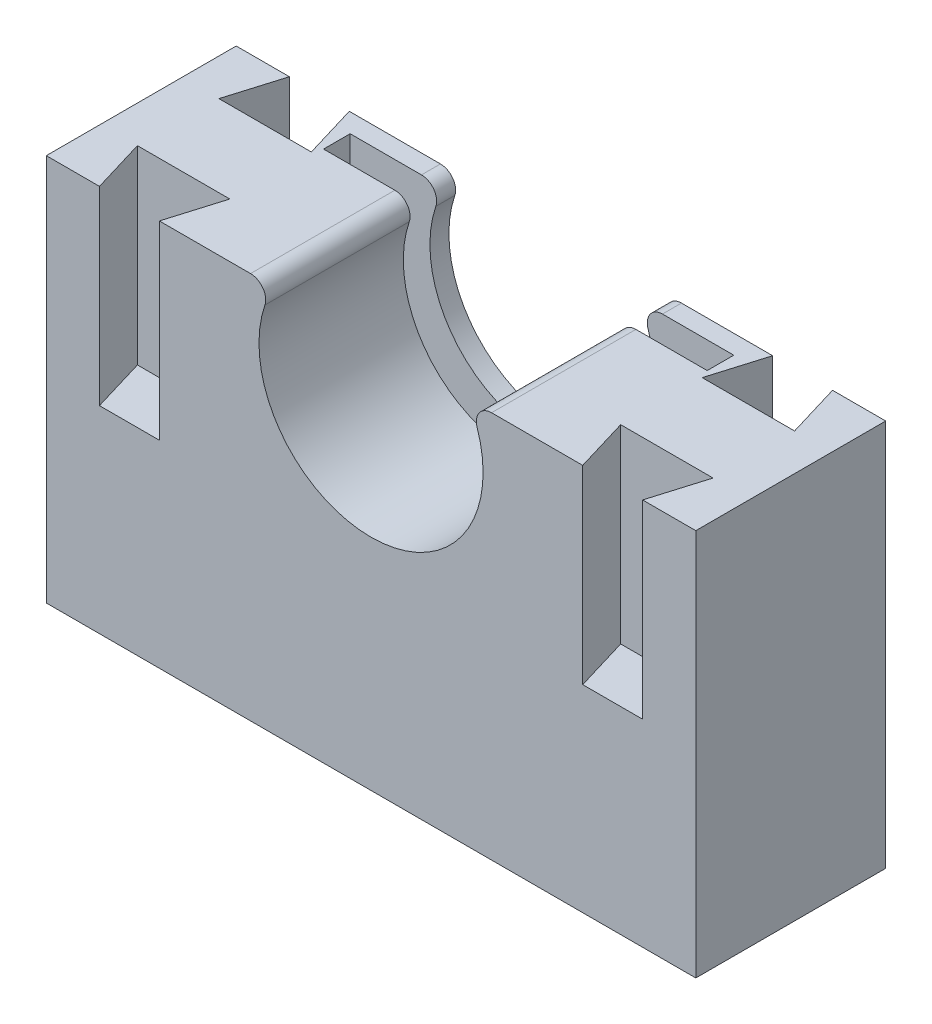
ISO-10303-21;
HEADER;
FILE_DESCRIPTION(('STEP AP214'),'2;1');
FILE_NAME('part.step','',(''),(''),'','','');
FILE_SCHEMA(('AUTOMOTIVE_DESIGN { 1 0 10303 214 1 1 1 1 }'));
ENDSEC;
DATA;
#1=APPLICATION_CONTEXT('core data for automotive mechanical design processes');
#2=APPLICATION_PROTOCOL_DEFINITION('international standard','automotive_design',2000,#1);
#3=PRODUCT_CONTEXT('',#1,'mechanical');
#4=PRODUCT('Part','Part','',(#3));
#5=PRODUCT_RELATED_PRODUCT_CATEGORY('part','',(#4));
#6=PRODUCT_DEFINITION_FORMATION('','',#4);
#7=PRODUCT_DEFINITION_CONTEXT('part definition',#1,'design');
#8=PRODUCT_DEFINITION('design','',#6,#7);
#9=PRODUCT_DEFINITION_SHAPE('','',#8);
#10=(LENGTH_UNIT() NAMED_UNIT(*) SI_UNIT(.MILLI.,.METRE.));
#11=(NAMED_UNIT(*) PLANE_ANGLE_UNIT() SI_UNIT($,.RADIAN.));
#12=(NAMED_UNIT(*) SI_UNIT($,.STERADIAN.) SOLID_ANGLE_UNIT());
#13=UNCERTAINTY_MEASURE_WITH_UNIT(LENGTH_MEASURE(1.E-05),#10,'distance_accuracy_value','');
#14=(GEOMETRIC_REPRESENTATION_CONTEXT(3) GLOBAL_UNCERTAINTY_ASSIGNED_CONTEXT((#13)) GLOBAL_UNIT_ASSIGNED_CONTEXT((#10,
#11,#12)) REPRESENTATION_CONTEXT('',''));
#15=CARTESIAN_POINT('',(0.,0.,0.));
#16=DIRECTION('',(0.,0.,1.));
#17=DIRECTION('',(1.,0.,0.));
#18=AXIS2_PLACEMENT_3D('',#15,#16,#17);
#19=CARTESIAN_POINT('',(27.0146670463276,26.0149253731343,25.));
#20=DIRECTION('',(0.,0.,-1.));
#21=DIRECTION('',(-1.,0.,0.));
#22=AXIS2_PLACEMENT_3D('',#19,#20,#21);
#23=CYLINDRICAL_SURFACE('',#22,2.);
#24=CARTESIAN_POINT('',(27.0146670463276,26.0149253731343,2.5));
#25=DIRECTION('',(0.,0.,1.));
#26=DIRECTION('',(1.,0.,0.));
#27=AXIS2_PLACEMENT_3D('',#24,#25,#26);
#28=CIRCLE('',#27,2.);
#29=CARTESIAN_POINT('',(27.0146670463276,28.0149253731343,2.5));
#30=VERTEX_POINT('',#29);
#31=CARTESIAN_POINT('',(25.1204378482512,25.3731343283582,2.5));
#32=VERTEX_POINT('',#31);
#33=EDGE_CURVE('E296',#30,#32,#28,.T.);
#34=ORIENTED_EDGE('',*,*,#33,.F.);
#35=DIRECTION('',(0.,0.,-1.));
#36=VECTOR('',#35,1.);
#37=CARTESIAN_POINT('',(27.0146670463276,28.0149253731343,25.));
#38=LINE('',#37,#36);
#39=CARTESIAN_POINT('',(27.0146670463276,28.0149253731343,0.));
#40=VERTEX_POINT('',#39);
#41=EDGE_CURVE('E549',#30,#40,#38,.T.);
#42=ORIENTED_EDGE('',*,*,#41,.T.);
#43=CARTESIAN_POINT('',(27.0146670463276,26.0149253731343,0.));
#44=DIRECTION('',(0.,0.,1.));
#45=DIRECTION('',(1.,0.,0.));
#46=AXIS2_PLACEMENT_3D('',#43,#44,#45);
#47=CIRCLE('',#46,2.);
#48=CARTESIAN_POINT('',(25.1204378482512,25.3731343283582,0.));
#49=VERTEX_POINT('',#48);
#50=EDGE_CURVE('E501',#40,#49,#47,.T.);
#51=ORIENTED_EDGE('',*,*,#50,.T.);
#52=DIRECTION('',(0.,0.,-1.));
#53=VECTOR('',#52,1.);
#54=CARTESIAN_POINT('',(25.1204378482512,25.3731343283582,25.));
#55=LINE('',#54,#53);
#56=EDGE_CURVE('E544',#32,#49,#55,.T.);
#57=ORIENTED_EDGE('',*,*,#56,.F.);
#58=EDGE_LOOP('',(#34,#42,#51,#57));
#59=FACE_BOUND('',#58,.T.);
#60=ADVANCED_FACE('F44',(#59),#23,.T.);
#61=CARTESIAN_POINT('',(11.1504975124378,20.6399253731341,25.));
#62=DIRECTION('',(0.,0.,-1.));
#63=DIRECTION('',(-1.,0.,0.));
#64=AXIS2_PLACEMENT_3D('',#61,#62,#63);
#65=CYLINDRICAL_SURFACE('',#64,14.75);
#66=CARTESIAN_POINT('',(11.1504975124378,20.6399253731341,2.5));
#67=DIRECTION('',(0.,0.,1.));
#68=DIRECTION('',(1.,0.,0.));
#69=AXIS2_PLACEMENT_3D('',#66,#67,#68);
#70=CIRCLE('',#69,14.75);
#71=CARTESIAN_POINT('',(-2.81944282337562,25.3731343283582,2.5));
#72=VERTEX_POINT('',#71);
#73=EDGE_CURVE('E60',#32,#72,#70,.F.);
#74=ORIENTED_EDGE('',*,*,#73,.F.);
#75=ORIENTED_EDGE('',*,*,#56,.T.);
#76=CARTESIAN_POINT('',(11.1504975124378,20.6399253731341,0.));
#77=DIRECTION('',(0.,0.,-1.));
#78=DIRECTION('',(1.,0.,0.));
#79=AXIS2_PLACEMENT_3D('',#76,#77,#78);
#80=CIRCLE('',#79,14.75);
#81=CARTESIAN_POINT('',(-2.81944282337562,25.3731343283582,0.));
#82=VERTEX_POINT('',#81);
#83=EDGE_CURVE('E505',#49,#82,#80,.T.);
#84=ORIENTED_EDGE('',*,*,#83,.T.);
#85=DIRECTION('',(0.,0.,-1.));
#86=VECTOR('',#85,1.);
#87=CARTESIAN_POINT('',(-2.81944282337562,25.3731343283582,25.));
#88=LINE('',#87,#86);
#89=EDGE_CURVE('E539',#72,#82,#88,.T.);
#90=ORIENTED_EDGE('',*,*,#89,.F.);
#91=EDGE_LOOP('',(#74,#75,#84,#90));
#92=FACE_BOUND('',#91,.T.);
#93=ADVANCED_FACE('F672',(#92),#65,.F.);
#94=CARTESIAN_POINT('',(-4.71367202145201,26.0149253731343,25.));
#95=DIRECTION('',(0.,0.,-1.));
#96=DIRECTION('',(-1.,0.,0.));
#97=AXIS2_PLACEMENT_3D('',#94,#95,#96);
#98=CYLINDRICAL_SURFACE('',#97,2.);
#99=CARTESIAN_POINT('',(-4.71367202145201,26.0149253731343,2.5));
#100=DIRECTION('',(0.,0.,1.));
#101=DIRECTION('',(1.,0.,0.));
#102=AXIS2_PLACEMENT_3D('',#99,#100,#101);
#103=CIRCLE('',#102,2.);
#104=CARTESIAN_POINT('',(-4.71367202145201,28.0149253731343,2.5));
#105=VERTEX_POINT('',#104);
#106=EDGE_CURVE('E53',#72,#105,#103,.T.);
#107=ORIENTED_EDGE('',*,*,#106,.F.);
#108=ORIENTED_EDGE('',*,*,#89,.T.);
#109=CARTESIAN_POINT('',(-4.71367202145201,26.0149253731343,0.));
#110=DIRECTION('',(0.,0.,1.));
#111=DIRECTION('',(-1.,0.,0.));
#112=AXIS2_PLACEMENT_3D('',#109,#110,#111);
#113=CIRCLE('',#112,2.);
#114=CARTESIAN_POINT('',(-4.71367202145201,28.0149253731343,0.));
#115=VERTEX_POINT('',#114);
#116=EDGE_CURVE('E509',#82,#115,#113,.T.);
#117=ORIENTED_EDGE('',*,*,#116,.T.);
#118=DIRECTION('',(0.,0.,-1.));
#119=VECTOR('',#118,1.);
#120=CARTESIAN_POINT('',(-4.71367202145201,28.0149253731343,25.));
#121=LINE('',#120,#119);
#122=EDGE_CURVE('E534',#105,#115,#121,.T.);
#123=ORIENTED_EDGE('',*,*,#122,.F.);
#124=EDGE_LOOP('',(#107,#108,#117,#123));
#125=FACE_BOUND('',#124,.T.);
#126=ADVANCED_FACE('F577',(#125),#98,.T.);
#127=CARTESIAN_POINT('',(53.9004975124378,28.0149253731343,25.));
#128=DIRECTION('',(0.,-1.,0.));
#129=DIRECTION('',(1.,0.,0.));
#130=AXIS2_PLACEMENT_3D('',#127,#128,#129);
#131=PLANE('',#130);
#132=DIRECTION('',(0.,0.,-1.));
#133=VECTOR('',#132,1.);
#134=CARTESIAN_POINT('',(36.4004975124378,28.0149253731343,6.));
#135=LINE('',#134,#133);
#136=CARTESIAN_POINT('',(36.4004975124378,28.0149253731343,6.));
#137=VERTEX_POINT('',#136);
#138=CARTESIAN_POINT('',(36.4004975124378,28.0149253731343,2.5));
#139=VERTEX_POINT('',#138);
#140=EDGE_CURVE('E272',#137,#139,#135,.T.);
#141=ORIENTED_EDGE('',*,*,#140,.F.);
#142=DIRECTION('',(1.,0.,0.));
#143=VECTOR('',#142,1.);
#144=CARTESIAN_POINT('',(36.4004975124378,28.0149253731343,6.));
#145=LINE('',#144,#143);
#146=CARTESIAN_POINT('',(27.0146670463276,28.0149253731343,6.));
#147=VERTEX_POINT('',#146);
#148=EDGE_CURVE('E254',#147,#137,#145,.T.);
#149=ORIENTED_EDGE('',*,*,#148,.F.);
#150=CARTESIAN_POINT('',(27.0146670463276,28.0149253731343,25.));
#151=VERTEX_POINT('',#150);
#152=EDGE_CURVE('E550',#151,#147,#38,.T.);
#153=ORIENTED_EDGE('',*,*,#152,.F.);
#154=DIRECTION('',(-1.,0.,0.));
#155=VECTOR('',#154,1.);
#156=CARTESIAN_POINT('',(53.9004975124378,28.0149253731343,25.));
#157=LINE('',#156,#155);
#158=CARTESIAN_POINT('',(39.0146670463276,28.0149253731343,25.));
#159=VERTEX_POINT('',#158);
#160=EDGE_CURVE('E467',#159,#151,#157,.T.);
#161=ORIENTED_EDGE('',*,*,#160,.F.);
#162=DIRECTION('',(-0.287193343911959,0.,-0.957872634128707));
#163=VECTOR('',#162,1.);
#164=CARTESIAN_POINT('',(39.0146670463276,28.0149253731343,25.));
#165=LINE('',#164,#163);
#166=CARTESIAN_POINT('',(36.8750766341835,28.0149253731343,17.8638488757411));
#167=VERTEX_POINT('',#166);
#168=EDGE_CURVE('E366',#159,#167,#165,.T.);
#169=ORIENTED_EDGE('',*,*,#168,.T.);
#170=DIRECTION('',(1.,0.,0.));
#171=VECTOR('',#170,1.);
#172=CARTESIAN_POINT('',(36.8750766341835,28.0149253731343,17.8638488757411));
#173=LINE('',#172,#171);
#174=CARTESIAN_POINT('',(49.0400879245819,28.0149253731343,17.8638488757411));
#175=VERTEX_POINT('',#174);
#176=EDGE_CURVE('E370',#167,#175,#173,.T.);
#177=ORIENTED_EDGE('',*,*,#176,.T.);
#178=DIRECTION('',(-0.287193343911958,0.,0.957872634128707));
#179=VECTOR('',#178,1.);
#180=CARTESIAN_POINT('',(49.0400879245819,28.0149253731343,17.8638488757411));
#181=LINE('',#180,#179);
#182=CARTESIAN_POINT('',(46.9004975124378,28.0149253731343,25.));
#183=VERTEX_POINT('',#182);
#184=EDGE_CURVE('E374',#175,#183,#181,.T.);
#185=ORIENTED_EDGE('',*,*,#184,.T.);
#186=CARTESIAN_POINT('',(53.9004975124378,28.0149253731343,25.));
#187=VERTEX_POINT('',#186);
#188=EDGE_CURVE('E469',#187,#183,#157,.T.);
#189=ORIENTED_EDGE('',*,*,#188,.F.);
#190=DIRECTION('',(0.,0.,-1.));
#191=VECTOR('',#190,1.);
#192=CARTESIAN_POINT('',(53.9004975124378,28.0149253731343,25.));
#193=LINE('',#192,#191);
#194=CARTESIAN_POINT('',(53.9004975124378,28.0149253731343,0.));
#195=VERTEX_POINT('',#194);
#196=EDGE_CURVE('E553',#187,#195,#193,.T.);
#197=ORIENTED_EDGE('',*,*,#196,.T.);
#198=DIRECTION('',(-1.,0.,0.));
#199=VECTOR('',#198,1.);
#200=CARTESIAN_POINT('',(53.9004975124378,28.0149253731343,0.));
#201=LINE('',#200,#199);
#202=CARTESIAN_POINT('',(46.9004975124378,28.0149253731343,0.));
#203=VERTEX_POINT('',#202);
#204=EDGE_CURVE('E497',#195,#203,#201,.T.);
#205=ORIENTED_EDGE('',*,*,#204,.T.);
#206=DIRECTION('',(0.287193343911966,0.,0.957872634128704));
#207=VECTOR('',#206,1.);
#208=CARTESIAN_POINT('',(46.9004975124378,28.0149253731343,0.));
#209=LINE('',#208,#207);
#210=CARTESIAN_POINT('',(49.040087924582,28.0149253731343,7.13615112425885));
#211=VERTEX_POINT('',#210);
#212=EDGE_CURVE('E378',#203,#211,#209,.T.);
#213=ORIENTED_EDGE('',*,*,#212,.T.);
#214=DIRECTION('',(-1.,0.,0.));
#215=VECTOR('',#214,1.);
#216=CARTESIAN_POINT('',(49.040087924582,28.0149253731343,7.13615112425885));
#217=LINE('',#216,#215);
#218=CARTESIAN_POINT('',(36.8750766341835,28.0149253731343,7.13615112425885));
#219=VERTEX_POINT('',#218);
#220=EDGE_CURVE('E382',#211,#219,#217,.T.);
#221=ORIENTED_EDGE('',*,*,#220,.T.);
#222=DIRECTION('',(0.287193343911964,0.,-0.957872634128705));
#223=VECTOR('',#222,1.);
#224=CARTESIAN_POINT('',(36.8750766341835,28.0149253731343,7.13615112425885));
#225=LINE('',#224,#223);
#226=CARTESIAN_POINT('',(39.0146670463276,28.0149253731343,0.));
#227=VERTEX_POINT('',#226);
#228=EDGE_CURVE('E386',#219,#227,#225,.T.);
#229=ORIENTED_EDGE('',*,*,#228,.T.);
#230=EDGE_CURVE('E496',#227,#40,#201,.T.);
#231=ORIENTED_EDGE('',*,*,#230,.T.);
#232=ORIENTED_EDGE('',*,*,#41,.F.);
#233=DIRECTION('',(1.,0.,0.));
#234=VECTOR('',#233,1.);
#235=CARTESIAN_POINT('',(36.4004975124378,28.0149253731343,2.5));
#236=LINE('',#235,#234);
#237=EDGE_CURVE('E282',#30,#139,#236,.T.);
#238=ORIENTED_EDGE('',*,*,#237,.T.);
#239=EDGE_LOOP('',(#141,#149,#153,#161,#169,#177,#185,#189,#197,#205,#213,#221,#229,#231,#232,#238));
#240=FACE_BOUND('',#239,.T.);
#241=ADVANCED_FACE('F280',(#240),#131,.F.);
#242=CARTESIAN_POINT('',(-4.71367202145201,28.0149253731343,25.));
#243=DIRECTION('',(0.,-1.,0.));
#244=DIRECTION('',(1.,0.,0.));
#245=AXIS2_PLACEMENT_3D('',#242,#243,#244);
#246=PLANE('',#245);
#247=CARTESIAN_POINT('',(-4.71367202145201,28.0149253731343,25.));
#248=VERTEX_POINT('',#247);
#249=CARTESIAN_POINT('',(-4.71367202145201,28.0149253731343,6.));
#250=VERTEX_POINT('',#249);
#251=EDGE_CURVE('E535',#248,#250,#121,.T.);
#252=ORIENTED_EDGE('',*,*,#251,.T.);
#253=CARTESIAN_POINT('',(-14.0995024875622,28.0149253731343,6.));
#254=VERTEX_POINT('',#253);
#255=EDGE_CURVE('E266',#254,#250,#145,.T.);
#256=ORIENTED_EDGE('',*,*,#255,.F.);
#257=DIRECTION('',(0.,0.,-1.));
#258=VECTOR('',#257,1.);
#259=CARTESIAN_POINT('',(-14.0995024875622,28.0149253731343,6.));
#260=LINE('',#259,#258);
#261=CARTESIAN_POINT('',(-14.0995024875622,28.0149253731343,2.5));
#262=VERTEX_POINT('',#261);
#263=EDGE_CURVE('E297',#254,#262,#260,.T.);
#264=ORIENTED_EDGE('',*,*,#263,.T.);
#265=EDGE_CURVE('E565',#262,#105,#236,.T.);
#266=ORIENTED_EDGE('',*,*,#265,.T.);
#267=ORIENTED_EDGE('',*,*,#122,.T.);
#268=DIRECTION('',(-1.,0.,0.));
#269=VECTOR('',#268,1.);
#270=CARTESIAN_POINT('',(-4.71367202145201,28.0149253731343,0.));
#271=LINE('',#270,#269);
#272=CARTESIAN_POINT('',(-16.713672021452,28.0149253731343,0.));
#273=VERTEX_POINT('',#272);
#274=EDGE_CURVE('E514',#115,#273,#271,.T.);
#275=ORIENTED_EDGE('',*,*,#274,.T.);
#276=DIRECTION('',(0.287115798996212,0.,0.95789588054588));
#277=VECTOR('',#276,1.);
#278=CARTESIAN_POINT('',(-14.5746593189302,28.0149253731343,7.13632431006681));
#279=LINE('',#278,#277);
#280=CARTESIAN_POINT('',(-14.5746593189302,28.0149253731343,7.13632431006681));
#281=VERTEX_POINT('',#280);
#282=EDGE_CURVE('E390',#273,#281,#279,.T.);
#283=ORIENTED_EDGE('',*,*,#282,.T.);
#284=DIRECTION('',(-1.,0.,0.));
#285=VECTOR('',#284,1.);
#286=CARTESIAN_POINT('',(-26.738515190084,28.0149253731343,7.13632431006681));
#287=LINE('',#286,#285);
#288=CARTESIAN_POINT('',(-26.738515190084,28.0149253731343,7.13632431006681));
#289=VERTEX_POINT('',#288);
#290=EDGE_CURVE('E394',#281,#289,#287,.T.);
#291=ORIENTED_EDGE('',*,*,#290,.T.);
#292=DIRECTION('',(0.287115798996211,0.,-0.95789588054588));
#293=VECTOR('',#292,1.);
#294=CARTESIAN_POINT('',(-24.5995024875622,28.0149253731343,0.));
#295=LINE('',#294,#293);
#296=CARTESIAN_POINT('',(-24.5995024875622,28.0149253731343,0.));
#297=VERTEX_POINT('',#296);
#298=EDGE_CURVE('E311',#289,#297,#295,.T.);
#299=ORIENTED_EDGE('',*,*,#298,.T.);
#300=CARTESIAN_POINT('',(-31.5995024875622,28.0149253731343,0.));
#301=VERTEX_POINT('',#300);
#302=EDGE_CURVE('E513',#297,#301,#271,.T.);
#303=ORIENTED_EDGE('',*,*,#302,.T.);
#304=DIRECTION('',(0.,0.,-1.));
#305=VECTOR('',#304,1.);
#306=CARTESIAN_POINT('',(-31.5995024875622,28.0149253731343,25.));
#307=LINE('',#306,#305);
#308=CARTESIAN_POINT('',(-31.5995024875622,28.0149253731343,25.));
#309=VERTEX_POINT('',#308);
#310=EDGE_CURVE('E530',#309,#301,#307,.T.);
#311=ORIENTED_EDGE('',*,*,#310,.F.);
#312=DIRECTION('',(-1.,0.,0.));
#313=VECTOR('',#312,1.);
#314=CARTESIAN_POINT('',(-4.71367202145201,28.0149253731343,25.));
#315=LINE('',#314,#313);
#316=CARTESIAN_POINT('',(-24.5995024875622,28.0149253731343,25.));
#317=VERTEX_POINT('',#316);
#318=EDGE_CURVE('E482',#317,#309,#315,.T.);
#319=ORIENTED_EDGE('',*,*,#318,.F.);
#320=DIRECTION('',(-0.28719334391196,0.,-0.957872634128706));
#321=VECTOR('',#320,1.);
#322=CARTESIAN_POINT('',(-24.5995024875622,28.0149253731343,25.));
#323=LINE('',#322,#321);
#324=CARTESIAN_POINT('',(-26.7390928997063,28.0149253731343,17.8638488757411));
#325=VERTEX_POINT('',#324);
#326=EDGE_CURVE('E68',#317,#325,#323,.T.);
#327=ORIENTED_EDGE('',*,*,#326,.T.);
#328=DIRECTION('',(1.,0.,0.));
#329=VECTOR('',#328,1.);
#330=CARTESIAN_POINT('',(-26.7390928997063,28.0149253731343,17.8638488757411));
#331=LINE('',#330,#329);
#332=CARTESIAN_POINT('',(-14.5740816093079,28.0149253731343,17.8638488757411));
#333=VERTEX_POINT('',#332);
#334=EDGE_CURVE('E358',#325,#333,#331,.T.);
#335=ORIENTED_EDGE('',*,*,#334,.T.);
#336=DIRECTION('',(-0.287193343911959,0.,0.957872634128707));
#337=VECTOR('',#336,1.);
#338=CARTESIAN_POINT('',(-14.5740816093079,28.0149253731343,17.8638488757411));
#339=LINE('',#338,#337);
#340=CARTESIAN_POINT('',(-16.713672021452,28.0149253731343,25.));
#341=VERTEX_POINT('',#340);
#342=EDGE_CURVE('E362',#333,#341,#339,.T.);
#343=ORIENTED_EDGE('',*,*,#342,.T.);
#344=EDGE_CURVE('E483',#248,#341,#315,.T.);
#345=ORIENTED_EDGE('',*,*,#344,.F.);
#346=EDGE_LOOP('',(#252,#256,#264,#266,#267,#275,#283,#291,#299,#303,#311,#319,#327,#335,#343,#345));
#347=FACE_BOUND('',#346,.T.);
#348=ADVANCED_FACE('F572',(#347),#246,.F.);
#349=CARTESIAN_POINT('',(-4.71367202145201,26.0149253731343,25.));
#350=DIRECTION('',(0.,0.,-1.));
#351=DIRECTION('',(-1.,0.,0.));
#352=AXIS2_PLACEMENT_3D('',#349,#350,#351);
#353=PLANE('',#352);
#354=DIRECTION('',(0.,1.,0.));
#355=VECTOR('',#354,1.);
#356=CARTESIAN_POINT('',(46.9004975124378,3.01492537313434,25.));
#357=LINE('',#356,#355);
#358=CARTESIAN_POINT('',(46.9004975124378,3.01492537313434,25.));
#359=VERTEX_POINT('',#358);
#360=EDGE_CURVE('E428',#359,#183,#357,.T.);
#361=ORIENTED_EDGE('',*,*,#360,.F.);
#362=DIRECTION('',(1.,0.,0.));
#363=VECTOR('',#362,1.);
#364=CARTESIAN_POINT('',(-4.71367202145201,3.01492537313433,25.));
#365=LINE('',#364,#363);
#366=CARTESIAN_POINT('',(39.0146670463276,3.01492537313434,25.));
#367=VERTEX_POINT('',#366);
#368=EDGE_CURVE('E404',#367,#359,#365,.T.);
#369=ORIENTED_EDGE('',*,*,#368,.F.);
#370=DIRECTION('',(0.,1.,0.));
#371=VECTOR('',#370,1.);
#372=CARTESIAN_POINT('',(39.0146670463276,3.01492537313434,25.));
#373=LINE('',#372,#371);
#374=EDGE_CURVE('E437',#367,#159,#373,.T.);
#375=ORIENTED_EDGE('',*,*,#374,.T.);
#376=ORIENTED_EDGE('',*,*,#160,.T.);
#377=CARTESIAN_POINT('',(27.0146670463276,26.0149253731343,25.));
#378=DIRECTION('',(0.,0.,1.));
#379=DIRECTION('',(1.,0.,0.));
#380=AXIS2_PLACEMENT_3D('',#377,#378,#379);
#381=CIRCLE('',#380,2.);
#382=CARTESIAN_POINT('',(25.1204378482512,25.3731343283582,25.));
#383=VERTEX_POINT('',#382);
#384=EDGE_CURVE('E473',#151,#383,#381,.T.);
#385=ORIENTED_EDGE('',*,*,#384,.T.);
#386=CARTESIAN_POINT('',(11.1504975124378,20.6399253731341,25.));
#387=DIRECTION('',(0.,0.,-1.));
#388=DIRECTION('',(1.,0.,0.));
#389=AXIS2_PLACEMENT_3D('',#386,#387,#388);
#390=CIRCLE('',#389,14.75);
#391=CARTESIAN_POINT('',(-2.81944282337562,25.3731343283582,25.));
#392=VERTEX_POINT('',#391);
#393=EDGE_CURVE('E476',#383,#392,#390,.T.);
#394=ORIENTED_EDGE('',*,*,#393,.T.);
#395=CARTESIAN_POINT('',(-4.71367202145201,26.0149253731343,25.));
#396=DIRECTION('',(0.,0.,1.));
#397=DIRECTION('',(-1.,0.,0.));
#398=AXIS2_PLACEMENT_3D('',#395,#396,#397);
#399=CIRCLE('',#398,2.);
#400=EDGE_CURVE('E479',#392,#248,#399,.T.);
#401=ORIENTED_EDGE('',*,*,#400,.T.);
#402=ORIENTED_EDGE('',*,*,#344,.T.);
#403=DIRECTION('',(0.,1.,0.));
#404=VECTOR('',#403,1.);
#405=CARTESIAN_POINT('',(-16.713672021452,3.01492537313433,25.));
#406=LINE('',#405,#404);
#407=CARTESIAN_POINT('',(-16.713672021452,3.01492537313433,25.));
#408=VERTEX_POINT('',#407);
#409=EDGE_CURVE('E441',#408,#341,#406,.T.);
#410=ORIENTED_EDGE('',*,*,#409,.F.);
#411=CARTESIAN_POINT('',(-24.5995024875622,3.01492537313433,25.));
#412=VERTEX_POINT('',#411);
#413=EDGE_CURVE('E454',#412,#408,#365,.T.);
#414=ORIENTED_EDGE('',*,*,#413,.F.);
#415=DIRECTION('',(0.,1.,0.));
#416=VECTOR('',#415,1.);
#417=CARTESIAN_POINT('',(-24.5995024875622,3.01492537313433,25.));
#418=LINE('',#417,#416);
#419=EDGE_CURVE('E355',#412,#317,#418,.T.);
#420=ORIENTED_EDGE('',*,*,#419,.T.);
#421=ORIENTED_EDGE('',*,*,#318,.T.);
#422=DIRECTION('',(0.,-1.,0.));
#423=VECTOR('',#422,1.);
#424=CARTESIAN_POINT('',(-31.5995024875622,28.0149253731343,25.));
#425=LINE('',#424,#423);
#426=CARTESIAN_POINT('',(-31.5995024875622,-22.9850746268657,25.));
#427=VERTEX_POINT('',#426);
#428=EDGE_CURVE('E487',#309,#427,#425,.T.);
#429=ORIENTED_EDGE('',*,*,#428,.T.);
#430=DIRECTION('',(1.,0.,0.));
#431=VECTOR('',#430,1.);
#432=CARTESIAN_POINT('',(53.9004975124378,-22.9850746268657,25.));
#433=LINE('',#432,#431);
#434=CARTESIAN_POINT('',(53.9004975124378,-22.9850746268657,25.));
#435=VERTEX_POINT('',#434);
#436=EDGE_CURVE('E490',#427,#435,#433,.T.);
#437=ORIENTED_EDGE('',*,*,#436,.T.);
#438=DIRECTION('',(0.,1.,0.));
#439=VECTOR('',#438,1.);
#440=CARTESIAN_POINT('',(53.9004975124378,28.0149253731343,25.));
#441=LINE('',#440,#439);
#442=EDGE_CURVE('E464',#435,#187,#441,.T.);
#443=ORIENTED_EDGE('',*,*,#442,.T.);
#444=ORIENTED_EDGE('',*,*,#188,.T.);
#445=EDGE_LOOP('',(#361,#369,#375,#376,#385,#394,#401,#402,#410,#414,#420,#421,#429,#437,#443,#444));
#446=FACE_BOUND('',#445,.T.);
#447=ADVANCED_FACE('F614',(#446),#353,.F.);
#448=CARTESIAN_POINT('',(53.9004975124378,28.0149253731343,25.));
#449=DIRECTION('',(-1.,0.,0.));
#450=DIRECTION('',(0.,0.,1.));
#451=AXIS2_PLACEMENT_3D('',#448,#449,#450);
#452=PLANE('',#451);
#453=ORIENTED_EDGE('',*,*,#196,.F.);
#454=ORIENTED_EDGE('',*,*,#442,.F.);
#455=DIRECTION('',(0.,0.,-1.));
#456=VECTOR('',#455,1.);
#457=CARTESIAN_POINT('',(53.9004975124378,-22.9850746268657,25.));
#458=LINE('',#457,#456);
#459=CARTESIAN_POINT('',(53.9004975124378,-22.9850746268657,0.));
#460=VERTEX_POINT('',#459);
#461=EDGE_CURVE('E493',#435,#460,#458,.T.);
#462=ORIENTED_EDGE('',*,*,#461,.T.);
#463=DIRECTION('',(0.,1.,0.));
#464=VECTOR('',#463,1.);
#465=CARTESIAN_POINT('',(53.9004975124378,28.0149253731343,0.));
#466=LINE('',#465,#464);
#467=EDGE_CURVE('E459',#460,#195,#466,.T.);
#468=ORIENTED_EDGE('',*,*,#467,.T.);
#469=EDGE_LOOP('',(#453,#454,#462,#468));
#470=FACE_BOUND('',#469,.T.);
#471=ADVANCED_FACE('F46',(#470),#452,.F.);
#472=ORIENTED_EDGE('',*,*,#152,.T.);
#473=CARTESIAN_POINT('',(27.0146670463276,26.0149253731343,6.));
#474=DIRECTION('',(0.,0.,1.));
#475=DIRECTION('',(1.,0.,0.));
#476=AXIS2_PLACEMENT_3D('',#473,#474,#475);
#477=CIRCLE('',#476,2.);
#478=CARTESIAN_POINT('',(25.1204378482512,25.3731343283582,6.));
#479=VERTEX_POINT('',#478);
#480=EDGE_CURVE('E260',#147,#479,#477,.T.);
#481=ORIENTED_EDGE('',*,*,#480,.T.);
#482=EDGE_CURVE('E545',#383,#479,#55,.T.);
#483=ORIENTED_EDGE('',*,*,#482,.F.);
#484=ORIENTED_EDGE('',*,*,#384,.F.);
#485=EDGE_LOOP('',(#472,#481,#483,#484));
#486=FACE_BOUND('',#485,.T.);
#487=ADVANCED_FACE('F622',(#486),#23,.T.);
#488=ORIENTED_EDGE('',*,*,#482,.T.);
#489=CARTESIAN_POINT('',(11.1504975124378,20.6399253731341,6.));
#490=DIRECTION('',(0.,0.,1.));
#491=DIRECTION('',(1.,0.,0.));
#492=AXIS2_PLACEMENT_3D('',#489,#490,#491);
#493=CIRCLE('',#492,14.75);
#494=CARTESIAN_POINT('',(-2.81944282337562,25.3731343283582,6.));
#495=VERTEX_POINT('',#494);
#496=EDGE_CURVE('E300',#479,#495,#493,.F.);
#497=ORIENTED_EDGE('',*,*,#496,.T.);
#498=EDGE_CURVE('E540',#392,#495,#88,.T.);
#499=ORIENTED_EDGE('',*,*,#498,.F.);
#500=ORIENTED_EDGE('',*,*,#393,.F.);
#501=EDGE_LOOP('',(#488,#497,#499,#500));
#502=FACE_BOUND('',#501,.T.);
#503=ADVANCED_FACE('F620',(#502),#65,.F.);
#504=ORIENTED_EDGE('',*,*,#498,.T.);
#505=CARTESIAN_POINT('',(-4.71367202145201,26.0149253731343,6.));
#506=DIRECTION('',(0.,0.,1.));
#507=DIRECTION('',(1.,0.,0.));
#508=AXIS2_PLACEMENT_3D('',#505,#506,#507);
#509=CIRCLE('',#508,2.);
#510=EDGE_CURVE('E12',#495,#250,#509,.T.);
#511=ORIENTED_EDGE('',*,*,#510,.T.);
#512=ORIENTED_EDGE('',*,*,#251,.F.);
#513=ORIENTED_EDGE('',*,*,#400,.F.);
#514=EDGE_LOOP('',(#504,#511,#512,#513));
#515=FACE_BOUND('',#514,.T.);
#516=ADVANCED_FACE('F606',(#515),#98,.T.);
#517=CARTESIAN_POINT('',(-31.5995024875622,28.0149253731343,25.));
#518=DIRECTION('',(1.,0.,0.));
#519=DIRECTION('',(0.,0.,-1.));
#520=AXIS2_PLACEMENT_3D('',#517,#518,#519);
#521=PLANE('',#520);
#522=DIRECTION('',(0.,-1.,0.));
#523=VECTOR('',#522,1.);
#524=CARTESIAN_POINT('',(-31.5995024875622,28.0149253731343,0.));
#525=LINE('',#524,#523);
#526=CARTESIAN_POINT('',(-31.5995024875622,-22.9850746268657,0.));
#527=VERTEX_POINT('',#526);
#528=EDGE_CURVE('E518',#301,#527,#525,.T.);
#529=ORIENTED_EDGE('',*,*,#528,.T.);
#530=DIRECTION('',(0.,0.,-1.));
#531=VECTOR('',#530,1.);
#532=CARTESIAN_POINT('',(-31.5995024875622,-22.9850746268657,25.));
#533=LINE('',#532,#531);
#534=EDGE_CURVE('E526',#427,#527,#533,.T.);
#535=ORIENTED_EDGE('',*,*,#534,.F.);
#536=ORIENTED_EDGE('',*,*,#428,.F.);
#537=ORIENTED_EDGE('',*,*,#310,.T.);
#538=EDGE_LOOP('',(#529,#535,#536,#537));
#539=FACE_BOUND('',#538,.T.);
#540=ADVANCED_FACE('F690',(#539),#521,.F.);
#541=CARTESIAN_POINT('',(53.9004975124378,-22.9850746268657,25.));
#542=DIRECTION('',(0.,1.,0.));
#543=DIRECTION('',(0.,0.,1.));
#544=AXIS2_PLACEMENT_3D('',#541,#542,#543);
#545=PLANE('',#544);
#546=DIRECTION('',(1.,0.,0.));
#547=VECTOR('',#546,1.);
#548=CARTESIAN_POINT('',(53.9004975124378,-22.9850746268657,0.));
#549=LINE('',#548,#547);
#550=EDGE_CURVE('E468',#527,#460,#549,.T.);
#551=ORIENTED_EDGE('',*,*,#550,.T.);
#552=ORIENTED_EDGE('',*,*,#461,.F.);
#553=ORIENTED_EDGE('',*,*,#436,.F.);
#554=ORIENTED_EDGE('',*,*,#534,.T.);
#555=EDGE_LOOP('',(#551,#552,#553,#554));
#556=FACE_BOUND('',#555,.T.);
#557=ADVANCED_FACE('F693',(#556),#545,.F.);
#558=CARTESIAN_POINT('',(-4.71367202145201,26.0149253731343,0.));
#559=DIRECTION('',(0.,0.,-1.));
#560=DIRECTION('',(-1.,0.,0.));
#561=AXIS2_PLACEMENT_3D('',#558,#559,#560);
#562=PLANE('',#561);
#563=ORIENTED_EDGE('',*,*,#204,.F.);
#564=ORIENTED_EDGE('',*,*,#467,.F.);
#565=ORIENTED_EDGE('',*,*,#550,.F.);
#566=ORIENTED_EDGE('',*,*,#528,.F.);
#567=ORIENTED_EDGE('',*,*,#302,.F.);
#568=DIRECTION('',(0.,1.,0.));
#569=VECTOR('',#568,1.);
#570=CARTESIAN_POINT('',(-24.5995024875622,3.01492537313433,0.));
#571=LINE('',#570,#569);
#572=CARTESIAN_POINT('',(-24.5995024875622,3.01492537313433,0.));
#573=VERTEX_POINT('',#572);
#574=EDGE_CURVE('E401',#573,#297,#571,.T.);
#575=ORIENTED_EDGE('',*,*,#574,.F.);
#576=DIRECTION('',(1.,0.,0.));
#577=VECTOR('',#576,1.);
#578=CARTESIAN_POINT('',(-4.71367202145201,3.01492537313433,0.));
#579=LINE('',#578,#577);
#580=CARTESIAN_POINT('',(-16.713672021452,3.01492537313433,0.));
#581=VERTEX_POINT('',#580);
#582=EDGE_CURVE('E558',#573,#581,#579,.T.);
#583=ORIENTED_EDGE('',*,*,#582,.T.);
#584=DIRECTION('',(0.,1.,0.));
#585=VECTOR('',#584,1.);
#586=CARTESIAN_POINT('',(-16.713672021452,3.01492537313433,0.));
#587=LINE('',#586,#585);
#588=EDGE_CURVE('E411',#581,#273,#587,.T.);
#589=ORIENTED_EDGE('',*,*,#588,.T.);
#590=ORIENTED_EDGE('',*,*,#274,.F.);
#591=ORIENTED_EDGE('',*,*,#116,.F.);
#592=ORIENTED_EDGE('',*,*,#83,.F.);
#593=ORIENTED_EDGE('',*,*,#50,.F.);
#594=ORIENTED_EDGE('',*,*,#230,.F.);
#595=DIRECTION('',(0.,1.,0.));
#596=VECTOR('',#595,1.);
#597=CARTESIAN_POINT('',(39.0146670463276,3.01492537313434,0.));
#598=LINE('',#597,#596);
#599=CARTESIAN_POINT('',(39.0146670463276,3.01492537313434,0.));
#600=VERTEX_POINT('',#599);
#601=EDGE_CURVE('E415',#600,#227,#598,.T.);
#602=ORIENTED_EDGE('',*,*,#601,.F.);
#603=CARTESIAN_POINT('',(46.9004975124378,3.01492537313434,0.));
#604=VERTEX_POINT('',#603);
#605=EDGE_CURVE('E557',#600,#604,#579,.T.);
#606=ORIENTED_EDGE('',*,*,#605,.T.);
#607=DIRECTION('',(0.,1.,0.));
#608=VECTOR('',#607,1.);
#609=CARTESIAN_POINT('',(46.9004975124378,3.01492537313434,0.));
#610=LINE('',#609,#608);
#611=EDGE_CURVE('E424',#604,#203,#610,.T.);
#612=ORIENTED_EDGE('',*,*,#611,.T.);
#613=EDGE_LOOP('',(#563,#564,#565,#566,#567,#575,#583,#589,#590,#591,#592,#593,#594,#602,#606,#612));
#614=FACE_BOUND('',#613,.T.);
#615=CARTESIAN_POINT('',(11.1504975124378,-2.91007462686588,0.));
#616=DIRECTION('',(0.,0.,-1.));
#617=DIRECTION('',(-1.,0.,0.));
#618=AXIS2_PLACEMENT_3D('',#615,#616,#617);
#619=CIRCLE('',#618,4.4);
#620=CARTESIAN_POINT('',(6.75049751243781,-2.91007462686588,0.));
#621=VERTEX_POINT('',#620);
#622=EDGE_CURVE('E460',#621,#621,#619,.T.);
#623=ORIENTED_EDGE('',*,*,#622,.F.);
#624=EDGE_LOOP('',(#623));
#625=FACE_BOUND('',#624,.T.);
#626=ADVANCED_FACE('F646',(#614,#625),#562,.T.);
#627=CARTESIAN_POINT('',(11.1504975124378,-2.91007462686588,4.8));
#628=DIRECTION('',(0.,0.,-1.));
#629=DIRECTION('',(-1.,0.,0.));
#630=AXIS2_PLACEMENT_3D('',#627,#628,#629);
#631=CYLINDRICAL_SURFACE('',#630,4.4);
#632=CARTESIAN_POINT('',(11.1504975124378,-2.91007462686588,4.8));
#633=DIRECTION('',(0.,0.,-1.));
#634=DIRECTION('',(-1.,0.,0.));
#635=AXIS2_PLACEMENT_3D('',#632,#633,#634);
#636=CIRCLE('',#635,4.4);
#637=CARTESIAN_POINT('',(6.75049751243781,-2.91007462686588,4.8));
#638=VERTEX_POINT('',#637);
#639=EDGE_CURVE('E455',#638,#638,#636,.T.);
#640=ORIENTED_EDGE('',*,*,#639,.F.);
#641=EDGE_LOOP('',(#640));
#642=FACE_BOUND('',#641,.T.);
#643=ORIENTED_EDGE('',*,*,#622,.T.);
#644=EDGE_LOOP('',(#643));
#645=FACE_BOUND('',#644,.T.);
#646=ADVANCED_FACE('F700',(#642,#645),#631,.F.);
#647=CARTESIAN_POINT('',(11.1504975124378,-2.91007462686588,4.8));
#648=DIRECTION('',(0.,0.,-1.));
#649=DIRECTION('',(-1.,0.,0.));
#650=AXIS2_PLACEMENT_3D('',#647,#648,#649);
#651=PLANE('',#650);
#652=ORIENTED_EDGE('',*,*,#639,.T.);
#653=EDGE_LOOP('',(#652));
#654=FACE_BOUND('',#653,.T.);
#655=ADVANCED_FACE('F725',(#654),#651,.T.);
#656=CARTESIAN_POINT('',(46.9004975124378,3.01492537313434,0.));
#657=DIRECTION('',(-0.957872634128705,0.,0.287193343911966));
#658=DIRECTION('',(0.287193343911966,0.,0.957872634128705));
#659=AXIS2_PLACEMENT_3D('',#656,#657,#658);
#660=PLANE('',#659);
#661=ORIENTED_EDGE('',*,*,#212,.F.);
#662=ORIENTED_EDGE('',*,*,#611,.F.);
#663=DIRECTION('',(0.287193343911966,0.,0.957872634128704));
#664=VECTOR('',#663,1.);
#665=CARTESIAN_POINT('',(46.9004975124378,3.01492537313434,0.));
#666=LINE('',#665,#664);
#667=CARTESIAN_POINT('',(49.040087924582,3.01492537313434,7.13615112425885));
#668=VERTEX_POINT('',#667);
#669=EDGE_CURVE('E331',#604,#668,#666,.T.);
#670=ORIENTED_EDGE('',*,*,#669,.T.);
#671=DIRECTION('',(0.,1.,0.));
#672=VECTOR('',#671,1.);
#673=CARTESIAN_POINT('',(49.040087924582,3.01492537313434,7.13615112425885));
#674=LINE('',#673,#672);
#675=EDGE_CURVE('E421',#668,#211,#674,.T.);
#676=ORIENTED_EDGE('',*,*,#675,.T.);
#677=EDGE_LOOP('',(#661,#662,#670,#676));
#678=FACE_BOUND('',#677,.T.);
#679=ADVANCED_FACE('F653',(#678),#660,.T.);
#680=CARTESIAN_POINT('',(36.8750766341835,3.01492537313433,7.13615112425885));
#681=DIRECTION('',(0.957872634128705,0.,0.287193343911964));
#682=DIRECTION('',(0.287193343911965,0.,-0.957872634128705));
#683=AXIS2_PLACEMENT_3D('',#680,#681,#682);
#684=PLANE('',#683);
#685=ORIENTED_EDGE('',*,*,#228,.F.);
#686=DIRECTION('',(0.,1.,0.));
#687=VECTOR('',#686,1.);
#688=CARTESIAN_POINT('',(36.8750766341835,3.01492537313433,7.13615112425885));
#689=LINE('',#688,#687);
#690=CARTESIAN_POINT('',(36.8750766341835,3.01492537313433,7.13615112425885));
#691=VERTEX_POINT('',#690);
#692=EDGE_CURVE('E418',#691,#219,#689,.T.);
#693=ORIENTED_EDGE('',*,*,#692,.F.);
#694=DIRECTION('',(0.287193343911964,0.,-0.957872634128705));
#695=VECTOR('',#694,1.);
#696=CARTESIAN_POINT('',(36.8750766341835,3.01492537313433,7.13615112425885));
#697=LINE('',#696,#695);
#698=EDGE_CURVE('E339',#691,#600,#697,.T.);
#699=ORIENTED_EDGE('',*,*,#698,.T.);
#700=ORIENTED_EDGE('',*,*,#601,.T.);
#701=EDGE_LOOP('',(#685,#693,#699,#700));
#702=FACE_BOUND('',#701,.T.);
#703=ADVANCED_FACE('F732',(#702),#684,.T.);
#704=CARTESIAN_POINT('',(11.1504975124378,3.01492537313433,12.5));
#705=DIRECTION('',(0.,1.,0.));
#706=DIRECTION('',(-1.,0.,0.));
#707=AXIS2_PLACEMENT_3D('',#704,#705,#706);
#708=PLANE('',#707);
#709=ORIENTED_EDGE('',*,*,#698,.F.);
#710=DIRECTION('',(-1.,0.,0.));
#711=VECTOR('',#710,1.);
#712=CARTESIAN_POINT('',(49.040087924582,3.01492537313434,7.13615112425885));
#713=LINE('',#712,#711);
#714=EDGE_CURVE('E335',#668,#691,#713,.T.);
#715=ORIENTED_EDGE('',*,*,#714,.F.);
#716=ORIENTED_EDGE('',*,*,#669,.F.);
#717=ORIENTED_EDGE('',*,*,#605,.F.);
#718=EDGE_LOOP('',(#709,#715,#716,#717));
#719=FACE_BOUND('',#718,.T.);
#720=ADVANCED_FACE('F657',(#719),#708,.T.);
#721=CARTESIAN_POINT('',(49.040087924582,3.01492537313434,7.13615112425885));
#722=DIRECTION('',(0.,0.,-1.));
#723=DIRECTION('',(-1.,0.,0.));
#724=AXIS2_PLACEMENT_3D('',#721,#722,#723);
#725=PLANE('',#724);
#726=ORIENTED_EDGE('',*,*,#220,.F.);
#727=ORIENTED_EDGE('',*,*,#675,.F.);
#728=ORIENTED_EDGE('',*,*,#714,.T.);
#729=ORIENTED_EDGE('',*,*,#692,.T.);
#730=EDGE_LOOP('',(#726,#727,#728,#729));
#731=FACE_BOUND('',#730,.T.);
#732=ADVANCED_FACE('F660',(#731),#725,.T.);
#733=CARTESIAN_POINT('',(-14.5746593189302,3.01492537313433,7.13632431006681));
#734=DIRECTION('',(-0.95789588054588,0.,0.287115798996212));
#735=DIRECTION('',(0.287115798996212,0.,0.95789588054588));
#736=AXIS2_PLACEMENT_3D('',#733,#734,#735);
#737=PLANE('',#736);
#738=ORIENTED_EDGE('',*,*,#282,.F.);
#739=ORIENTED_EDGE('',*,*,#588,.F.);
#740=DIRECTION('',(0.287115798996212,0.,0.95789588054588));
#741=VECTOR('',#740,1.);
#742=CARTESIAN_POINT('',(-14.5746593189302,3.01492537313433,7.13632431006681));
#743=LINE('',#742,#741);
#744=CARTESIAN_POINT('',(-14.5746593189302,3.01492537313433,7.13632431006681));
#745=VERTEX_POINT('',#744);
#746=EDGE_CURVE('E343',#581,#745,#743,.T.);
#747=ORIENTED_EDGE('',*,*,#746,.T.);
#748=DIRECTION('',(0.,1.,0.));
#749=VECTOR('',#748,1.);
#750=CARTESIAN_POINT('',(-14.5746593189302,3.01492537313433,7.13632431006681));
#751=LINE('',#750,#749);
#752=EDGE_CURVE('E408',#745,#281,#751,.T.);
#753=ORIENTED_EDGE('',*,*,#752,.T.);
#754=EDGE_LOOP('',(#738,#739,#747,#753));
#755=FACE_BOUND('',#754,.T.);
#756=ADVANCED_FACE('F675',(#755),#737,.T.);
#757=CARTESIAN_POINT('',(-24.5995024875622,3.01492537313433,0.));
#758=DIRECTION('',(0.95789588054588,0.,0.287115798996211));
#759=DIRECTION('',(0.287115798996211,0.,-0.95789588054588));
#760=AXIS2_PLACEMENT_3D('',#757,#758,#759);
#761=PLANE('',#760);
#762=ORIENTED_EDGE('',*,*,#298,.F.);
#763=DIRECTION('',(0.,1.,0.));
#764=VECTOR('',#763,1.);
#765=CARTESIAN_POINT('',(-26.738515190084,3.01492537313433,7.13632431006681));
#766=LINE('',#765,#764);
#767=CARTESIAN_POINT('',(-26.738515190084,3.01492537313433,7.13632431006681));
#768=VERTEX_POINT('',#767);
#769=EDGE_CURVE('E405',#768,#289,#766,.T.);
#770=ORIENTED_EDGE('',*,*,#769,.F.);
#771=DIRECTION('',(0.287115798996211,0.,-0.95789588054588));
#772=VECTOR('',#771,1.);
#773=CARTESIAN_POINT('',(-24.5995024875622,3.01492537313433,0.));
#774=LINE('',#773,#772);
#775=EDGE_CURVE('E351',#768,#573,#774,.T.);
#776=ORIENTED_EDGE('',*,*,#775,.T.);
#777=ORIENTED_EDGE('',*,*,#574,.T.);
#778=EDGE_LOOP('',(#762,#770,#776,#777));
#779=FACE_BOUND('',#778,.T.);
#780=ADVANCED_FACE('F683',(#779),#761,.T.);
#781=ORIENTED_EDGE('',*,*,#775,.F.);
#782=DIRECTION('',(-1.,0.,0.));
#783=VECTOR('',#782,1.);
#784=CARTESIAN_POINT('',(-26.738515190084,3.01492537313433,7.13632431006681));
#785=LINE('',#784,#783);
#786=EDGE_CURVE('E347',#745,#768,#785,.T.);
#787=ORIENTED_EDGE('',*,*,#786,.F.);
#788=ORIENTED_EDGE('',*,*,#746,.F.);
#789=ORIENTED_EDGE('',*,*,#582,.F.);
#790=EDGE_LOOP('',(#781,#787,#788,#789));
#791=FACE_BOUND('',#790,.T.);
#792=ADVANCED_FACE('F734',(#791),#708,.T.);
#793=CARTESIAN_POINT('',(-26.738515190084,3.01492537313433,7.13632431006681));
#794=DIRECTION('',(0.,0.,-1.));
#795=DIRECTION('',(-1.,0.,0.));
#796=AXIS2_PLACEMENT_3D('',#793,#794,#795);
#797=PLANE('',#796);
#798=ORIENTED_EDGE('',*,*,#290,.F.);
#799=ORIENTED_EDGE('',*,*,#752,.F.);
#800=ORIENTED_EDGE('',*,*,#786,.T.);
#801=ORIENTED_EDGE('',*,*,#769,.T.);
#802=EDGE_LOOP('',(#798,#799,#800,#801));
#803=FACE_BOUND('',#802,.T.);
#804=ADVANCED_FACE('F679',(#803),#797,.T.);
#805=CARTESIAN_POINT('',(-14.5740816093079,3.01492537313433,17.8638488757411));
#806=DIRECTION('',(-0.957872634128707,0.,-0.287193343911959));
#807=DIRECTION('',(-0.287193343911959,0.,0.957872634128707));
#808=AXIS2_PLACEMENT_3D('',#805,#806,#807);
#809=PLANE('',#808);
#810=ORIENTED_EDGE('',*,*,#342,.F.);
#811=DIRECTION('',(0.,1.,0.));
#812=VECTOR('',#811,1.);
#813=CARTESIAN_POINT('',(-14.5740816093079,3.01492537313433,17.8638488757411));
#814=LINE('',#813,#812);
#815=CARTESIAN_POINT('',(-14.5740816093079,3.01492537313433,17.8638488757411));
#816=VERTEX_POINT('',#815);
#817=EDGE_CURVE('E444',#816,#333,#814,.T.);
#818=ORIENTED_EDGE('',*,*,#817,.F.);
#819=DIRECTION('',(-0.287193343911959,0.,0.957872634128707));
#820=VECTOR('',#819,1.);
#821=CARTESIAN_POINT('',(-14.5740816093079,3.01492537313433,17.8638488757411));
#822=LINE('',#821,#820);
#823=EDGE_CURVE('E315',#816,#408,#822,.T.);
#824=ORIENTED_EDGE('',*,*,#823,.T.);
#825=ORIENTED_EDGE('',*,*,#409,.T.);
#826=EDGE_LOOP('',(#810,#818,#824,#825));
#827=FACE_BOUND('',#826,.T.);
#828=ADVANCED_FACE('F738',(#827),#809,.T.);
#829=CARTESIAN_POINT('',(-24.5995024875622,3.01492537313433,25.));
#830=DIRECTION('',(0.957872634128706,0.,-0.28719334391196));
#831=DIRECTION('',(-0.28719334391196,0.,-0.957872634128707));
#832=AXIS2_PLACEMENT_3D('',#829,#830,#831);
#833=PLANE('',#832);
#834=ORIENTED_EDGE('',*,*,#326,.F.);
#835=ORIENTED_EDGE('',*,*,#419,.F.);
#836=DIRECTION('',(-0.28719334391196,0.,-0.957872634128706));
#837=VECTOR('',#836,1.);
#838=CARTESIAN_POINT('',(-24.5995024875622,3.01492537313433,25.));
#839=LINE('',#838,#837);
#840=CARTESIAN_POINT('',(-26.7390928997063,3.01492537313433,17.8638488757411));
#841=VERTEX_POINT('',#840);
#842=EDGE_CURVE('E306',#412,#841,#839,.T.);
#843=ORIENTED_EDGE('',*,*,#842,.T.);
#844=DIRECTION('',(0.,1.,0.));
#845=VECTOR('',#844,1.);
#846=CARTESIAN_POINT('',(-26.7390928997063,3.01492537313433,17.8638488757411));
#847=LINE('',#846,#845);
#848=EDGE_CURVE('E447',#841,#325,#847,.T.);
#849=ORIENTED_EDGE('',*,*,#848,.T.);
#850=EDGE_LOOP('',(#834,#835,#843,#849));
#851=FACE_BOUND('',#850,.T.);
#852=ADVANCED_FACE('F735',(#851),#833,.T.);
#853=ORIENTED_EDGE('',*,*,#413,.T.);
#854=ORIENTED_EDGE('',*,*,#823,.F.);
#855=DIRECTION('',(1.,0.,0.));
#856=VECTOR('',#855,1.);
#857=CARTESIAN_POINT('',(-26.7390928997063,3.01492537313433,17.8638488757411));
#858=LINE('',#857,#856);
#859=EDGE_CURVE('E310',#841,#816,#858,.T.);
#860=ORIENTED_EDGE('',*,*,#859,.F.);
#861=ORIENTED_EDGE('',*,*,#842,.F.);
#862=EDGE_LOOP('',(#853,#854,#860,#861));
#863=FACE_BOUND('',#862,.T.);
#864=ADVANCED_FACE('F733',(#863),#708,.T.);
#865=CARTESIAN_POINT('',(-26.7390928997063,3.01492537313433,17.8638488757411));
#866=DIRECTION('',(0.,0.,1.));
#867=DIRECTION('',(1.,0.,0.));
#868=AXIS2_PLACEMENT_3D('',#865,#866,#867);
#869=PLANE('',#868);
#870=ORIENTED_EDGE('',*,*,#334,.F.);
#871=ORIENTED_EDGE('',*,*,#848,.F.);
#872=ORIENTED_EDGE('',*,*,#859,.T.);
#873=ORIENTED_EDGE('',*,*,#817,.T.);
#874=EDGE_LOOP('',(#870,#871,#872,#873));
#875=FACE_BOUND('',#874,.T.);
#876=ADVANCED_FACE('F739',(#875),#869,.T.);
#877=ORIENTED_EDGE('',*,*,#368,.T.);
#878=DIRECTION('',(-0.287193343911958,0.,0.957872634128707));
#879=VECTOR('',#878,1.);
#880=CARTESIAN_POINT('',(49.0400879245819,3.01492537313434,17.8638488757411));
#881=LINE('',#880,#879);
#882=CARTESIAN_POINT('',(49.0400879245819,3.01492537313434,17.8638488757411));
#883=VERTEX_POINT('',#882);
#884=EDGE_CURVE('E327',#883,#359,#881,.T.);
#885=ORIENTED_EDGE('',*,*,#884,.F.);
#886=DIRECTION('',(1.,0.,0.));
#887=VECTOR('',#886,1.);
#888=CARTESIAN_POINT('',(36.8750766341835,3.01492537313433,17.8638488757411));
#889=LINE('',#888,#887);
#890=CARTESIAN_POINT('',(36.8750766341835,3.01492537313433,17.8638488757411));
#891=VERTEX_POINT('',#890);
#892=EDGE_CURVE('E323',#891,#883,#889,.T.);
#893=ORIENTED_EDGE('',*,*,#892,.F.);
#894=DIRECTION('',(-0.287193343911959,0.,-0.957872634128707));
#895=VECTOR('',#894,1.);
#896=CARTESIAN_POINT('',(39.0146670463276,3.01492537313434,25.));
#897=LINE('',#896,#895);
#898=EDGE_CURVE('E319',#367,#891,#897,.T.);
#899=ORIENTED_EDGE('',*,*,#898,.F.);
#900=EDGE_LOOP('',(#877,#885,#893,#899));
#901=FACE_BOUND('',#900,.T.);
#902=ADVANCED_FACE('F630',(#901),#708,.T.);
#903=CARTESIAN_POINT('',(49.0400879245819,3.01492537313434,17.8638488757411));
#904=DIRECTION('',(-0.957872634128707,0.,-0.287193343911958));
#905=DIRECTION('',(-0.287193343911958,0.,0.957872634128707));
#906=AXIS2_PLACEMENT_3D('',#903,#904,#905);
#907=PLANE('',#906);
#908=ORIENTED_EDGE('',*,*,#184,.F.);
#909=DIRECTION('',(0.,1.,0.));
#910=VECTOR('',#909,1.);
#911=CARTESIAN_POINT('',(49.0400879245819,3.01492537313434,17.8638488757411));
#912=LINE('',#911,#910);
#913=EDGE_CURVE('E431',#883,#175,#912,.T.);
#914=ORIENTED_EDGE('',*,*,#913,.F.);
#915=ORIENTED_EDGE('',*,*,#884,.T.);
#916=ORIENTED_EDGE('',*,*,#360,.T.);
#917=EDGE_LOOP('',(#908,#914,#915,#916));
#918=FACE_BOUND('',#917,.T.);
#919=ADVANCED_FACE('F750',(#918),#907,.T.);
#920=CARTESIAN_POINT('',(36.8750766341835,3.01492537313433,17.8638488757411));
#921=DIRECTION('',(0.,0.,1.));
#922=DIRECTION('',(1.,0.,0.));
#923=AXIS2_PLACEMENT_3D('',#920,#921,#922);
#924=PLANE('',#923);
#925=ORIENTED_EDGE('',*,*,#176,.F.);
#926=DIRECTION('',(0.,1.,0.));
#927=VECTOR('',#926,1.);
#928=CARTESIAN_POINT('',(36.8750766341835,3.01492537313433,17.8638488757411));
#929=LINE('',#928,#927);
#930=EDGE_CURVE('E434',#891,#167,#929,.T.);
#931=ORIENTED_EDGE('',*,*,#930,.F.);
#932=ORIENTED_EDGE('',*,*,#892,.T.);
#933=ORIENTED_EDGE('',*,*,#913,.T.);
#934=EDGE_LOOP('',(#925,#931,#932,#933));
#935=FACE_BOUND('',#934,.T.);
#936=ADVANCED_FACE('F634',(#935),#924,.T.);
#937=CARTESIAN_POINT('',(39.0146670463276,3.01492537313434,25.));
#938=DIRECTION('',(0.957872634128707,0.,-0.287193343911959));
#939=DIRECTION('',(-0.287193343911959,0.,-0.957872634128707));
#940=AXIS2_PLACEMENT_3D('',#937,#938,#939);
#941=PLANE('',#940);
#942=ORIENTED_EDGE('',*,*,#168,.F.);
#943=ORIENTED_EDGE('',*,*,#374,.F.);
#944=ORIENTED_EDGE('',*,*,#898,.T.);
#945=ORIENTED_EDGE('',*,*,#930,.T.);
#946=EDGE_LOOP('',(#942,#943,#944,#945));
#947=FACE_BOUND('',#946,.T.);
#948=ADVANCED_FACE('F627',(#947),#941,.T.);
#949=CARTESIAN_POINT('',(0.,0.,6.));
#950=DIRECTION('',(0.,0.,1.));
#951=DIRECTION('',(1.,0.,0.));
#952=AXIS2_PLACEMENT_3D('',#949,#950,#951);
#953=PLANE('',#952);
#954=ORIENTED_EDGE('',*,*,#148,.T.);
#955=DIRECTION('',(0.,-1.,0.));
#956=VECTOR('',#955,1.);
#957=CARTESIAN_POINT('',(36.4004975124378,2.94484566858384,6.));
#958=LINE('',#957,#956);
#959=CARTESIAN_POINT('',(36.4004975124378,2.94484566858384,6.));
#960=VERTEX_POINT('',#959);
#961=EDGE_CURVE('E258',#137,#960,#958,.T.);
#962=ORIENTED_EDGE('',*,*,#961,.T.);
#963=DIRECTION('',(-1.,0.,0.));
#964=VECTOR('',#963,1.);
#965=CARTESIAN_POINT('',(36.4004975124378,2.94484566858384,6.));
#966=LINE('',#965,#964);
#967=CARTESIAN_POINT('',(-14.0995024875622,2.94484566858384,6.));
#968=VERTEX_POINT('',#967);
#969=EDGE_CURVE('E277',#960,#968,#966,.T.);
#970=ORIENTED_EDGE('',*,*,#969,.T.);
#971=DIRECTION('',(0.,1.,0.));
#972=VECTOR('',#971,1.);
#973=CARTESIAN_POINT('',(-14.0995024875622,28.0149253731343,6.));
#974=LINE('',#973,#972);
#975=EDGE_CURVE('E284',#968,#254,#974,.T.);
#976=ORIENTED_EDGE('',*,*,#975,.T.);
#977=ORIENTED_EDGE('',*,*,#255,.T.);
#978=ORIENTED_EDGE('',*,*,#510,.F.);
#979=ORIENTED_EDGE('',*,*,#496,.F.);
#980=ORIENTED_EDGE('',*,*,#480,.F.);
#981=EDGE_LOOP('',(#954,#962,#970,#976,#977,#978,#979,#980));
#982=FACE_BOUND('',#981,.T.);
#983=ADVANCED_FACE('F256',(#982),#953,.F.);
#984=CARTESIAN_POINT('',(0.,0.,2.5));
#985=DIRECTION('',(0.,0.,1.));
#986=DIRECTION('',(1.,0.,0.));
#987=AXIS2_PLACEMENT_3D('',#984,#985,#986);
#988=PLANE('',#987);
#989=ORIENTED_EDGE('',*,*,#33,.T.);
#990=ORIENTED_EDGE('',*,*,#73,.T.);
#991=ORIENTED_EDGE('',*,*,#106,.T.);
#992=ORIENTED_EDGE('',*,*,#265,.F.);
#993=DIRECTION('',(0.,1.,0.));
#994=VECTOR('',#993,1.);
#995=CARTESIAN_POINT('',(-14.0995024875622,28.0149253731343,2.5));
#996=LINE('',#995,#994);
#997=CARTESIAN_POINT('',(-14.0995024875622,2.94484566858384,2.5));
#998=VERTEX_POINT('',#997);
#999=EDGE_CURVE('E267',#998,#262,#996,.T.);
#1000=ORIENTED_EDGE('',*,*,#999,.F.);
#1001=DIRECTION('',(-1.,0.,0.));
#1002=VECTOR('',#1001,1.);
#1003=CARTESIAN_POINT('',(36.4004975124378,2.94484566858384,2.5));
#1004=LINE('',#1003,#1002);
#1005=CARTESIAN_POINT('',(36.4004975124378,2.94484566858384,2.5));
#1006=VERTEX_POINT('',#1005);
#1007=EDGE_CURVE('E597',#1006,#998,#1004,.T.);
#1008=ORIENTED_EDGE('',*,*,#1007,.F.);
#1009=DIRECTION('',(0.,-1.,0.));
#1010=VECTOR('',#1009,1.);
#1011=CARTESIAN_POINT('',(36.4004975124378,2.94484566858384,2.5));
#1012=LINE('',#1011,#1010);
#1013=EDGE_CURVE('E575',#139,#1006,#1012,.T.);
#1014=ORIENTED_EDGE('',*,*,#1013,.F.);
#1015=ORIENTED_EDGE('',*,*,#237,.F.);
#1016=EDGE_LOOP('',(#989,#990,#991,#992,#1000,#1008,#1014,#1015));
#1017=FACE_BOUND('',#1016,.T.);
#1018=ADVANCED_FACE('F563',(#1017),#988,.T.);
#1019=CARTESIAN_POINT('',(-14.0995024875622,28.0149253731343,6.));
#1020=DIRECTION('',(-1.,0.,0.));
#1021=DIRECTION('',(0.,0.,1.));
#1022=AXIS2_PLACEMENT_3D('',#1019,#1020,#1021);
#1023=PLANE('',#1022);
#1024=ORIENTED_EDGE('',*,*,#999,.T.);
#1025=ORIENTED_EDGE('',*,*,#263,.F.);
#1026=ORIENTED_EDGE('',*,*,#975,.F.);
#1027=DIRECTION('',(0.,0.,-1.));
#1028=VECTOR('',#1027,1.);
#1029=CARTESIAN_POINT('',(-14.0995024875622,2.94484566858384,6.));
#1030=LINE('',#1029,#1028);
#1031=EDGE_CURVE('E288',#968,#998,#1030,.T.);
#1032=ORIENTED_EDGE('',*,*,#1031,.T.);
#1033=EDGE_LOOP('',(#1024,#1025,#1026,#1032));
#1034=FACE_BOUND('',#1033,.T.);
#1035=ADVANCED_FACE('F770',(#1034),#1023,.F.);
#1036=CARTESIAN_POINT('',(36.4004975124378,2.94484566858384,6.));
#1037=DIRECTION('',(0.,-1.,0.));
#1038=DIRECTION('',(1.,0.,0.));
#1039=AXIS2_PLACEMENT_3D('',#1036,#1037,#1038);
#1040=PLANE('',#1039);
#1041=ORIENTED_EDGE('',*,*,#1007,.T.);
#1042=ORIENTED_EDGE('',*,*,#1031,.F.);
#1043=ORIENTED_EDGE('',*,*,#969,.F.);
#1044=DIRECTION('',(0.,0.,-1.));
#1045=VECTOR('',#1044,1.);
#1046=CARTESIAN_POINT('',(36.4004975124378,2.94484566858384,6.));
#1047=LINE('',#1046,#1045);
#1048=EDGE_CURVE('E274',#960,#1006,#1047,.T.);
#1049=ORIENTED_EDGE('',*,*,#1048,.T.);
#1050=EDGE_LOOP('',(#1041,#1042,#1043,#1049));
#1051=FACE_BOUND('',#1050,.T.);
#1052=ADVANCED_FACE('F767',(#1051),#1040,.F.);
#1053=CARTESIAN_POINT('',(36.4004975124378,2.94484566858384,6.));
#1054=DIRECTION('',(1.,0.,0.));
#1055=DIRECTION('',(0.,0.,-1.));
#1056=AXIS2_PLACEMENT_3D('',#1053,#1054,#1055);
#1057=PLANE('',#1056);
#1058=ORIENTED_EDGE('',*,*,#1013,.T.);
#1059=ORIENTED_EDGE('',*,*,#1048,.F.);
#1060=ORIENTED_EDGE('',*,*,#961,.F.);
#1061=ORIENTED_EDGE('',*,*,#140,.T.);
#1062=EDGE_LOOP('',(#1058,#1059,#1060,#1061));
#1063=FACE_BOUND('',#1062,.T.);
#1064=ADVANCED_FACE('F271',(#1063),#1057,.F.);
#1065=CLOSED_SHELL('',(#60,#93,#126,#241,#348,#447,#471,#487,#503,#516,#540,#557,#626,#646,#655,
#679,#703,#720,#732,#756,#780,#792,#804,#828,#852,#864,#876,#902,#919,#936,#948,#983,#1018,
#1035,#1052,#1064));
#1066=MANIFOLD_SOLID_BREP('B2',#1065);
#1067=ADVANCED_BREP_SHAPE_REPRESENTATION('',(#18,#1066),#14);
#1068=SHAPE_DEFINITION_REPRESENTATION(#9,#1067);
ENDSEC;
END-ISO-10303-21;
